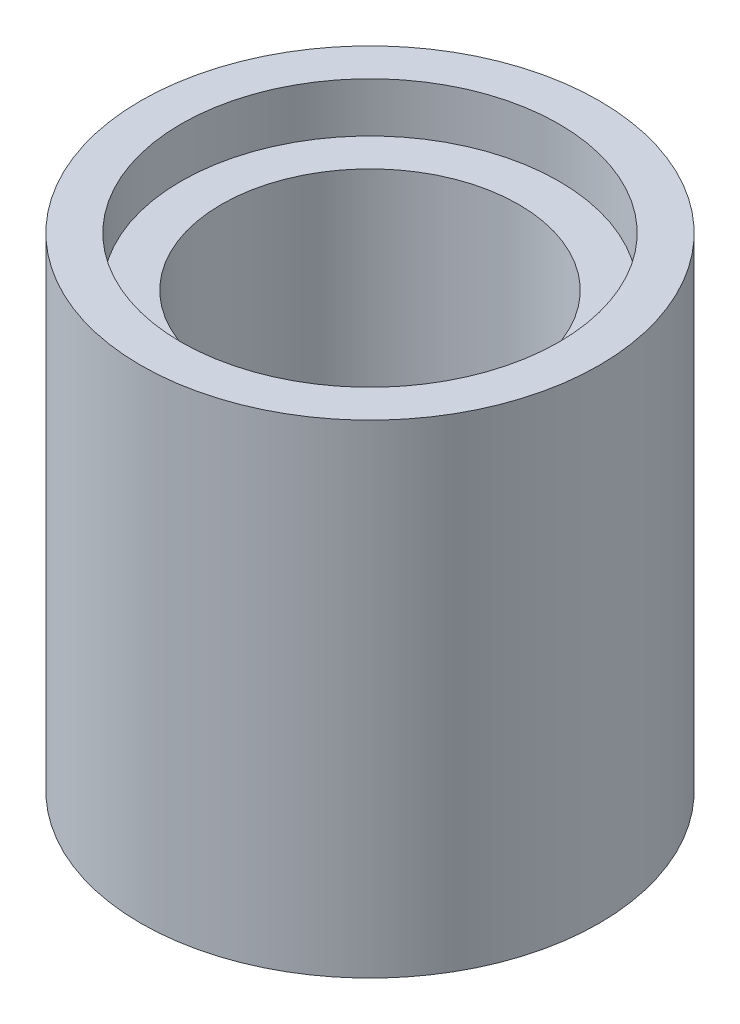
ISO-10303-21;
HEADER;
FILE_DESCRIPTION(('STEP AP214'),'2;1');
FILE_NAME('part.step','',(''),(''),'','','');
FILE_SCHEMA(('AUTOMOTIVE_DESIGN { 1 0 10303 214 1 1 1 1 }'));
ENDSEC;
DATA;
#1=APPLICATION_CONTEXT('core data for automotive mechanical design processes');
#2=APPLICATION_PROTOCOL_DEFINITION('international standard','automotive_design',2000,#1);
#3=PRODUCT_CONTEXT('',#1,'mechanical');
#4=PRODUCT('Part','Part','',(#3));
#5=PRODUCT_RELATED_PRODUCT_CATEGORY('part','',(#4));
#6=PRODUCT_DEFINITION_FORMATION('','',#4);
#7=PRODUCT_DEFINITION_CONTEXT('part definition',#1,'design');
#8=PRODUCT_DEFINITION('design','',#6,#7);
#9=PRODUCT_DEFINITION_SHAPE('','',#8);
#10=(LENGTH_UNIT() NAMED_UNIT(*) SI_UNIT(.MILLI.,.METRE.));
#11=(NAMED_UNIT(*) PLANE_ANGLE_UNIT() SI_UNIT($,.RADIAN.));
#12=(NAMED_UNIT(*) SI_UNIT($,.STERADIAN.) SOLID_ANGLE_UNIT());
#13=UNCERTAINTY_MEASURE_WITH_UNIT(LENGTH_MEASURE(1.E-05),#10,'distance_accuracy_value','');
#14=(GEOMETRIC_REPRESENTATION_CONTEXT(3) GLOBAL_UNCERTAINTY_ASSIGNED_CONTEXT((#13)) GLOBAL_UNIT_ASSIGNED_CONTEXT((#10,
#11,#12)) REPRESENTATION_CONTEXT('',''));
#15=CARTESIAN_POINT('',(0.,0.,0.));
#16=DIRECTION('',(0.,0.,1.));
#17=DIRECTION('',(1.,0.,0.));
#18=AXIS2_PLACEMENT_3D('',#15,#16,#17);
#19=CARTESIAN_POINT('',(-16.,0.,0.));
#20=DIRECTION('',(0.,1.,0.));
#21=DIRECTION('',(0.,0.,1.));
#22=AXIS2_PLACEMENT_3D('',#19,#20,#21);
#23=CYLINDRICAL_SURFACE('',#22,2.4);
#24=CARTESIAN_POINT('',(-16.,7.,0.));
#25=DIRECTION('',(0.,1.,0.));
#26=DIRECTION('',(0.,0.,1.));
#27=AXIS2_PLACEMENT_3D('',#24,#25,#26);
#28=CIRCLE('',#27,2.4);
#29=CARTESIAN_POINT('',(-16.,7.,2.4));
#30=VERTEX_POINT('',#29);
#31=EDGE_CURVE('E50',#30,#30,#28,.F.);
#32=ORIENTED_EDGE('',*,*,#31,.F.);
#33=EDGE_LOOP('',(#32));
#34=FACE_BOUND('',#33,.T.);
#35=CARTESIAN_POINT('',(-16.,0.8,0.));
#36=DIRECTION('',(0.,-1.,0.));
#37=DIRECTION('',(0.,0.,-1.));
#38=AXIS2_PLACEMENT_3D('',#35,#36,#37);
#39=CIRCLE('',#38,2.4);
#40=CARTESIAN_POINT('',(-16.,0.8,-2.4));
#41=VERTEX_POINT('',#40);
#42=EDGE_CURVE('E41',#41,#41,#39,.F.);
#43=ORIENTED_EDGE('',*,*,#42,.F.);
#44=EDGE_LOOP('',(#43));
#45=FACE_BOUND('',#44,.T.);
#46=ADVANCED_FACE('F37',(#34,#45),#23,.F.);
#47=CARTESIAN_POINT('',(-16.,7.8,0.));
#48=DIRECTION('',(0.,-1.,0.));
#49=DIRECTION('',(0.,0.,-1.));
#50=AXIS2_PLACEMENT_3D('',#47,#48,#49);
#51=CYLINDRICAL_SURFACE('',#50,3.7);
#52=CARTESIAN_POINT('',(-16.,7.8,0.));
#53=DIRECTION('',(0.,1.,0.));
#54=DIRECTION('',(0.,0.,1.));
#55=AXIS2_PLACEMENT_3D('',#52,#53,#54);
#56=CIRCLE('',#55,3.7);
#57=CARTESIAN_POINT('',(-16.,7.8,3.7));
#58=VERTEX_POINT('',#57);
#59=EDGE_CURVE('E10',#58,#58,#56,.T.);
#60=ORIENTED_EDGE('',*,*,#59,.F.);
#61=EDGE_LOOP('',(#60));
#62=FACE_BOUND('',#61,.T.);
#63=CARTESIAN_POINT('',(-16.,0.,0.));
#64=DIRECTION('',(0.,1.,0.));
#65=DIRECTION('',(0.,0.,1.));
#66=AXIS2_PLACEMENT_3D('',#63,#64,#65);
#67=CIRCLE('',#66,3.7);
#68=CARTESIAN_POINT('',(-16.,0.,3.7));
#69=VERTEX_POINT('',#68);
#70=EDGE_CURVE('E45',#69,#69,#67,.T.);
#71=ORIENTED_EDGE('',*,*,#70,.T.);
#72=EDGE_LOOP('',(#71));
#73=FACE_BOUND('',#72,.T.);
#74=ADVANCED_FACE('F39',(#62,#73),#51,.T.);
#75=CARTESIAN_POINT('',(-16.,7.8,0.));
#76=DIRECTION('',(0.,1.,0.));
#77=DIRECTION('',(0.,0.,1.));
#78=AXIS2_PLACEMENT_3D('',#75,#76,#77);
#79=PLANE('',#78);
#80=CARTESIAN_POINT('',(-16.,7.8,0.));
#81=DIRECTION('',(0.,1.,0.));
#82=DIRECTION('',(0.,0.,1.));
#83=AXIS2_PLACEMENT_3D('',#80,#81,#82);
#84=CIRCLE('',#83,3.05);
#85=CARTESIAN_POINT('',(-16.,7.8,3.05));
#86=VERTEX_POINT('',#85);
#87=EDGE_CURVE('E53',#86,#86,#84,.T.);
#88=ORIENTED_EDGE('',*,*,#87,.F.);
#89=EDGE_LOOP('',(#88));
#90=FACE_BOUND('',#89,.T.);
#91=ORIENTED_EDGE('',*,*,#59,.T.);
#92=EDGE_LOOP('',(#91));
#93=FACE_BOUND('',#92,.T.);
#94=ADVANCED_FACE('F82',(#90,#93),#79,.T.);
#95=CARTESIAN_POINT('',(-16.,0.,0.));
#96=DIRECTION('',(0.,1.,0.));
#97=DIRECTION('',(0.,0.,1.));
#98=AXIS2_PLACEMENT_3D('',#95,#96,#97);
#99=PLANE('',#98);
#100=CARTESIAN_POINT('',(-16.,0.,0.));
#101=DIRECTION('',(0.,-1.,0.));
#102=DIRECTION('',(0.,0.,-1.));
#103=AXIS2_PLACEMENT_3D('',#100,#101,#102);
#104=CIRCLE('',#103,3.05);
#105=CARTESIAN_POINT('',(-16.,0.,-3.05));
#106=VERTEX_POINT('',#105);
#107=EDGE_CURVE('E64',#106,#106,#104,.T.);
#108=ORIENTED_EDGE('',*,*,#107,.F.);
#109=EDGE_LOOP('',(#108));
#110=FACE_BOUND('',#109,.T.);
#111=ORIENTED_EDGE('',*,*,#70,.F.);
#112=EDGE_LOOP('',(#111));
#113=FACE_BOUND('',#112,.T.);
#114=ADVANCED_FACE('F89',(#110,#113),#99,.F.);
#115=CARTESIAN_POINT('',(-16.,7.,0.));
#116=DIRECTION('',(0.,1.,0.));
#117=DIRECTION('',(0.,0.,1.));
#118=AXIS2_PLACEMENT_3D('',#115,#116,#117);
#119=PLANE('',#118);
#120=CARTESIAN_POINT('',(-16.,7.,0.));
#121=DIRECTION('',(0.,1.,0.));
#122=DIRECTION('',(0.,0.,1.));
#123=AXIS2_PLACEMENT_3D('',#120,#121,#122);
#124=CIRCLE('',#123,3.05);
#125=CARTESIAN_POINT('',(-16.,7.,3.05));
#126=VERTEX_POINT('',#125);
#127=EDGE_CURVE('E56',#126,#126,#124,.T.);
#128=ORIENTED_EDGE('',*,*,#127,.T.);
#129=EDGE_LOOP('',(#128));
#130=FACE_BOUND('',#129,.T.);
#131=ORIENTED_EDGE('',*,*,#31,.T.);
#132=EDGE_LOOP('',(#131));
#133=FACE_BOUND('',#132,.T.);
#134=ADVANCED_FACE('F92',(#130,#133),#119,.T.);
#135=CARTESIAN_POINT('',(-16.,7.,0.));
#136=DIRECTION('',(0.,1.,0.));
#137=DIRECTION('',(0.,0.,1.));
#138=AXIS2_PLACEMENT_3D('',#135,#136,#137);
#139=CYLINDRICAL_SURFACE('',#138,3.05);
#140=ORIENTED_EDGE('',*,*,#127,.F.);
#141=EDGE_LOOP('',(#140));
#142=FACE_BOUND('',#141,.T.);
#143=ORIENTED_EDGE('',*,*,#87,.T.);
#144=EDGE_LOOP('',(#143));
#145=FACE_BOUND('',#144,.T.);
#146=ADVANCED_FACE('F86',(#142,#145),#139,.F.);
#147=CARTESIAN_POINT('',(-16.,0.8,0.));
#148=DIRECTION('',(0.,-1.,0.));
#149=DIRECTION('',(0.,0.,-1.));
#150=AXIS2_PLACEMENT_3D('',#147,#148,#149);
#151=PLANE('',#150);
#152=CARTESIAN_POINT('',(-16.,0.8,0.));
#153=DIRECTION('',(0.,-1.,0.));
#154=DIRECTION('',(0.,0.,-1.));
#155=AXIS2_PLACEMENT_3D('',#152,#153,#154);
#156=CIRCLE('',#155,3.05);
#157=CARTESIAN_POINT('',(-16.,0.8,-3.05));
#158=VERTEX_POINT('',#157);
#159=EDGE_CURVE('E67',#158,#158,#156,.T.);
#160=ORIENTED_EDGE('',*,*,#159,.T.);
#161=EDGE_LOOP('',(#160));
#162=FACE_BOUND('',#161,.T.);
#163=ORIENTED_EDGE('',*,*,#42,.T.);
#164=EDGE_LOOP('',(#163));
#165=FACE_BOUND('',#164,.T.);
#166=ADVANCED_FACE('F74',(#162,#165),#151,.T.);
#167=CARTESIAN_POINT('',(-16.,0.8,0.));
#168=DIRECTION('',(0.,-1.,0.));
#169=DIRECTION('',(0.,0.,-1.));
#170=AXIS2_PLACEMENT_3D('',#167,#168,#169);
#171=CYLINDRICAL_SURFACE('',#170,3.05);
#172=ORIENTED_EDGE('',*,*,#159,.F.);
#173=EDGE_LOOP('',(#172));
#174=FACE_BOUND('',#173,.T.);
#175=ORIENTED_EDGE('',*,*,#107,.T.);
#176=EDGE_LOOP('',(#175));
#177=FACE_BOUND('',#176,.T.);
#178=ADVANCED_FACE('F102',(#174,#177),#171,.F.);
#179=CLOSED_SHELL('',(#46,#74,#94,#114,#134,#146,#166,#178));
#180=MANIFOLD_SOLID_BREP('B2',#179);
#181=ADVANCED_BREP_SHAPE_REPRESENTATION('',(#18,#180),#14);
#182=SHAPE_DEFINITION_REPRESENTATION(#9,#181);
ENDSEC;
END-ISO-10303-21;
